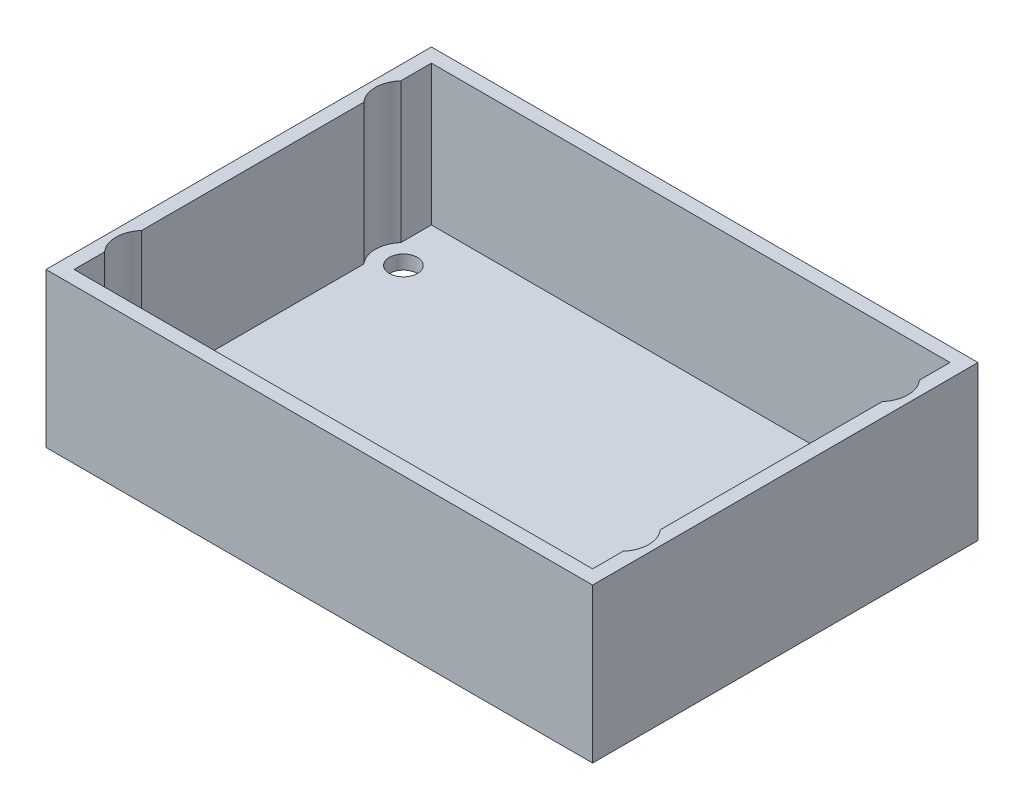
ISO-10303-21;
HEADER;
FILE_DESCRIPTION(('STEP AP214'),'2;1');
FILE_NAME('part.step','',(''),(''),'','','');
FILE_SCHEMA(('AUTOMOTIVE_DESIGN { 1 0 10303 214 1 1 1 1 }'));
ENDSEC;
DATA;
#1=APPLICATION_CONTEXT('core data for automotive mechanical design processes');
#2=APPLICATION_PROTOCOL_DEFINITION('international standard','automotive_design',2000,#1);
#3=PRODUCT_CONTEXT('',#1,'mechanical');
#4=PRODUCT('Part','Part','',(#3));
#5=PRODUCT_RELATED_PRODUCT_CATEGORY('part','',(#4));
#6=PRODUCT_DEFINITION_FORMATION('','',#4);
#7=PRODUCT_DEFINITION_CONTEXT('part definition',#1,'design');
#8=PRODUCT_DEFINITION('design','',#6,#7);
#9=PRODUCT_DEFINITION_SHAPE('','',#8);
#10=(LENGTH_UNIT() NAMED_UNIT(*) SI_UNIT(.MILLI.,.METRE.));
#11=(NAMED_UNIT(*) PLANE_ANGLE_UNIT() SI_UNIT($,.RADIAN.));
#12=(NAMED_UNIT(*) SI_UNIT($,.STERADIAN.) SOLID_ANGLE_UNIT());
#13=UNCERTAINTY_MEASURE_WITH_UNIT(LENGTH_MEASURE(1.E-05),#10,'distance_accuracy_value','');
#14=(GEOMETRIC_REPRESENTATION_CONTEXT(3) GLOBAL_UNCERTAINTY_ASSIGNED_CONTEXT((#13)) GLOBAL_UNIT_ASSIGNED_CONTEXT((#10,
#11,#12)) REPRESENTATION_CONTEXT('',''));
#15=CARTESIAN_POINT('',(0.,0.,0.));
#16=DIRECTION('',(0.,0.,1.));
#17=DIRECTION('',(1.,0.,0.));
#18=AXIS2_PLACEMENT_3D('',#15,#16,#17);
#19=CARTESIAN_POINT('',(76.,2.,-2.));
#20=DIRECTION('',(1.,0.,0.));
#21=DIRECTION('',(0.,0.,-1.));
#22=AXIS2_PLACEMENT_3D('',#19,#20,#21);
#23=PLANE('',#22);
#24=DIRECTION('',(0.,0.,-1.));
#25=VECTOR('',#24,1.);
#26=CARTESIAN_POINT('',(76.,2.,-2.));
#27=LINE('',#26,#25);
#28=CARTESIAN_POINT('',(76.,2.,-11.6457513110646));
#29=VERTEX_POINT('',#28);
#30=CARTESIAN_POINT('',(76.,2.,-43.3542486889354));
#31=VERTEX_POINT('',#30);
#32=EDGE_CURVE('E169',#29,#31,#27,.T.);
#33=ORIENTED_EDGE('',*,*,#32,.F.);
#34=DIRECTION('',(0.,1.,0.));
#35=VECTOR('',#34,1.);
#36=CARTESIAN_POINT('',(76.,2.,-11.6457513110646));
#37=LINE('',#36,#35);
#38=CARTESIAN_POINT('',(76.,22.,-11.6457513110646));
#39=VERTEX_POINT('',#38);
#40=EDGE_CURVE('E152',#29,#39,#37,.T.);
#41=ORIENTED_EDGE('',*,*,#40,.T.);
#42=DIRECTION('',(0.,0.,-1.));
#43=VECTOR('',#42,1.);
#44=CARTESIAN_POINT('',(76.,22.,-2.));
#45=LINE('',#44,#43);
#46=CARTESIAN_POINT('',(76.,22.,-43.3542486889354));
#47=VERTEX_POINT('',#46);
#48=EDGE_CURVE('E355',#39,#47,#45,.T.);
#49=ORIENTED_EDGE('',*,*,#48,.T.);
#50=DIRECTION('',(0.,1.,0.));
#51=VECTOR('',#50,1.);
#52=CARTESIAN_POINT('',(76.,2.,-43.3542486889354));
#53=LINE('',#52,#51);
#54=EDGE_CURVE('E208',#47,#31,#53,.F.);
#55=ORIENTED_EDGE('',*,*,#54,.T.);
#56=EDGE_LOOP('',(#33,#41,#49,#55));
#57=FACE_BOUND('',#56,.T.);
#58=ADVANCED_FACE('F35',(#57),#23,.F.);
#59=CARTESIAN_POINT('',(76.,2.,-48.6457513110646));
#60=VERTEX_POINT('',#59);
#61=CARTESIAN_POINT('',(76.,2.,-53.));
#62=VERTEX_POINT('',#61);
#63=EDGE_CURVE('E171',#60,#62,#27,.T.);
#64=ORIENTED_EDGE('',*,*,#63,.F.);
#65=DIRECTION('',(0.,1.,0.));
#66=VECTOR('',#65,1.);
#67=CARTESIAN_POINT('',(76.,2.,-48.6457513110646));
#68=LINE('',#67,#66);
#69=CARTESIAN_POINT('',(76.,22.,-48.6457513110646));
#70=VERTEX_POINT('',#69);
#71=EDGE_CURVE('E204',#60,#70,#68,.T.);
#72=ORIENTED_EDGE('',*,*,#71,.T.);
#73=CARTESIAN_POINT('',(76.,22.,-53.));
#74=VERTEX_POINT('',#73);
#75=EDGE_CURVE('E356',#70,#74,#45,.T.);
#76=ORIENTED_EDGE('',*,*,#75,.T.);
#77=DIRECTION('',(0.,1.,0.));
#78=VECTOR('',#77,1.);
#79=CARTESIAN_POINT('',(76.,2.,-53.));
#80=LINE('',#79,#78);
#81=EDGE_CURVE('E348',#62,#74,#80,.T.);
#82=ORIENTED_EDGE('',*,*,#81,.F.);
#83=EDGE_LOOP('',(#64,#72,#76,#82));
#84=FACE_BOUND('',#83,.T.);
#85=ADVANCED_FACE('F249',(#84),#23,.F.);
#86=CARTESIAN_POINT('',(2.,2.,-2.));
#87=DIRECTION('',(-1.,0.,0.));
#88=DIRECTION('',(0.,0.,1.));
#89=AXIS2_PLACEMENT_3D('',#86,#87,#88);
#90=PLANE('',#89);
#91=DIRECTION('',(0.,0.,1.));
#92=VECTOR('',#91,1.);
#93=CARTESIAN_POINT('',(2.,2.,-2.));
#94=LINE('',#93,#92);
#95=CARTESIAN_POINT('',(2.,2.,-43.3542486889354));
#96=VERTEX_POINT('',#95);
#97=CARTESIAN_POINT('',(2.,2.,-11.6457513110646));
#98=VERTEX_POINT('',#97);
#99=EDGE_CURVE('E180',#96,#98,#94,.T.);
#100=ORIENTED_EDGE('',*,*,#99,.F.);
#101=DIRECTION('',(0.,1.,0.));
#102=VECTOR('',#101,1.);
#103=CARTESIAN_POINT('',(2.,2.,-43.3542486889354));
#104=LINE('',#103,#102);
#105=CARTESIAN_POINT('',(2.,22.,-43.3542486889354));
#106=VERTEX_POINT('',#105);
#107=EDGE_CURVE('E194',#96,#106,#104,.T.);
#108=ORIENTED_EDGE('',*,*,#107,.T.);
#109=DIRECTION('',(0.,0.,1.));
#110=VECTOR('',#109,1.);
#111=CARTESIAN_POINT('',(2.,22.,-2.));
#112=LINE('',#111,#110);
#113=CARTESIAN_POINT('',(2.,22.,-11.6457513110646));
#114=VERTEX_POINT('',#113);
#115=EDGE_CURVE('E362',#106,#114,#112,.T.);
#116=ORIENTED_EDGE('',*,*,#115,.T.);
#117=DIRECTION('',(0.,1.,0.));
#118=VECTOR('',#117,1.);
#119=CARTESIAN_POINT('',(2.,2.,-11.6457513110646));
#120=LINE('',#119,#118);
#121=EDGE_CURVE('E188',#114,#98,#120,.F.);
#122=ORIENTED_EDGE('',*,*,#121,.T.);
#123=EDGE_LOOP('',(#100,#108,#116,#122));
#124=FACE_BOUND('',#123,.T.);
#125=ADVANCED_FACE('F255',(#124),#90,.F.);
#126=CARTESIAN_POINT('',(2.,2.,-6.3542486889354));
#127=VERTEX_POINT('',#126);
#128=CARTESIAN_POINT('',(2.,2.,-2.));
#129=VERTEX_POINT('',#128);
#130=EDGE_CURVE('E182',#127,#129,#94,.T.);
#131=ORIENTED_EDGE('',*,*,#130,.F.);
#132=DIRECTION('',(0.,1.,0.));
#133=VECTOR('',#132,1.);
#134=CARTESIAN_POINT('',(2.,2.,-6.3542486889354));
#135=LINE('',#134,#133);
#136=CARTESIAN_POINT('',(2.,22.,-6.3542486889354));
#137=VERTEX_POINT('',#136);
#138=EDGE_CURVE('E184',#127,#137,#135,.T.);
#139=ORIENTED_EDGE('',*,*,#138,.T.);
#140=CARTESIAN_POINT('',(2.,22.,-2.));
#141=VERTEX_POINT('',#140);
#142=EDGE_CURVE('E187',#137,#141,#112,.T.);
#143=ORIENTED_EDGE('',*,*,#142,.T.);
#144=DIRECTION('',(0.,1.,0.));
#145=VECTOR('',#144,1.);
#146=CARTESIAN_POINT('',(2.,2.,-2.));
#147=LINE('',#146,#145);
#148=EDGE_CURVE('E173',#129,#141,#147,.T.);
#149=ORIENTED_EDGE('',*,*,#148,.F.);
#150=EDGE_LOOP('',(#131,#139,#143,#149));
#151=FACE_BOUND('',#150,.T.);
#152=ADVANCED_FACE('F275',(#151),#90,.F.);
#153=CARTESIAN_POINT('',(0.,22.,0.));
#154=DIRECTION('',(1.,0.,0.));
#155=DIRECTION('',(0.,0.,-1.));
#156=AXIS2_PLACEMENT_3D('',#153,#154,#155);
#157=PLANE('',#156);
#158=DIRECTION('',(0.,0.,1.));
#159=VECTOR('',#158,1.);
#160=CARTESIAN_POINT('',(0.,0.,0.));
#161=LINE('',#160,#159);
#162=CARTESIAN_POINT('',(0.,0.,-55.));
#163=VERTEX_POINT('',#162);
#164=CARTESIAN_POINT('',(0.,0.,0.));
#165=VERTEX_POINT('',#164);
#166=EDGE_CURVE('E333',#163,#165,#161,.T.);
#167=ORIENTED_EDGE('',*,*,#166,.T.);
#168=DIRECTION('',(0.,-1.,0.));
#169=VECTOR('',#168,1.);
#170=CARTESIAN_POINT('',(0.,22.,0.));
#171=LINE('',#170,#169);
#172=CARTESIAN_POINT('',(0.,22.,0.));
#173=VERTEX_POINT('',#172);
#174=EDGE_CURVE('E11',#173,#165,#171,.T.);
#175=ORIENTED_EDGE('',*,*,#174,.F.);
#176=DIRECTION('',(0.,0.,1.));
#177=VECTOR('',#176,1.);
#178=CARTESIAN_POINT('',(0.,22.,0.));
#179=LINE('',#178,#177);
#180=CARTESIAN_POINT('',(0.,22.,-55.));
#181=VERTEX_POINT('',#180);
#182=EDGE_CURVE('E328',#181,#173,#179,.T.);
#183=ORIENTED_EDGE('',*,*,#182,.F.);
#184=DIRECTION('',(0.,-1.,0.));
#185=VECTOR('',#184,1.);
#186=CARTESIAN_POINT('',(0.,22.,-55.));
#187=LINE('',#186,#185);
#188=EDGE_CURVE('E322',#181,#163,#187,.T.);
#189=ORIENTED_EDGE('',*,*,#188,.T.);
#190=EDGE_LOOP('',(#167,#175,#183,#189));
#191=FACE_BOUND('',#190,.T.);
#192=ADVANCED_FACE('F37',(#191),#157,.F.);
#193=CARTESIAN_POINT('',(0.,22.,0.));
#194=DIRECTION('',(0.,0.,-1.));
#195=DIRECTION('',(-1.,0.,0.));
#196=AXIS2_PLACEMENT_3D('',#193,#194,#195);
#197=PLANE('',#196);
#198=DIRECTION('',(1.,0.,0.));
#199=VECTOR('',#198,1.);
#200=CARTESIAN_POINT('',(0.,0.,0.));
#201=LINE('',#200,#199);
#202=CARTESIAN_POINT('',(78.,0.,0.));
#203=VERTEX_POINT('',#202);
#204=EDGE_CURVE('E331',#165,#203,#201,.T.);
#205=ORIENTED_EDGE('',*,*,#204,.T.);
#206=DIRECTION('',(0.,-1.,0.));
#207=VECTOR('',#206,1.);
#208=CARTESIAN_POINT('',(78.,22.,0.));
#209=LINE('',#208,#207);
#210=CARTESIAN_POINT('',(78.,22.,0.));
#211=VERTEX_POINT('',#210);
#212=EDGE_CURVE('E44',#211,#203,#209,.T.);
#213=ORIENTED_EDGE('',*,*,#212,.F.);
#214=DIRECTION('',(1.,0.,0.));
#215=VECTOR('',#214,1.);
#216=CARTESIAN_POINT('',(0.,22.,0.));
#217=LINE('',#216,#215);
#218=EDGE_CURVE('E340',#173,#211,#217,.T.);
#219=ORIENTED_EDGE('',*,*,#218,.F.);
#220=ORIENTED_EDGE('',*,*,#174,.T.);
#221=EDGE_LOOP('',(#205,#213,#219,#220));
#222=FACE_BOUND('',#221,.T.);
#223=ADVANCED_FACE('F403',(#222),#197,.F.);
#224=CARTESIAN_POINT('',(78.,22.,0.));
#225=DIRECTION('',(-1.,0.,0.));
#226=DIRECTION('',(0.,0.,1.));
#227=AXIS2_PLACEMENT_3D('',#224,#225,#226);
#228=PLANE('',#227);
#229=DIRECTION('',(0.,0.,-1.));
#230=VECTOR('',#229,1.);
#231=CARTESIAN_POINT('',(78.,0.,0.));
#232=LINE('',#231,#230);
#233=CARTESIAN_POINT('',(78.,0.,-55.));
#234=VERTEX_POINT('',#233);
#235=EDGE_CURVE('E329',#203,#234,#232,.T.);
#236=ORIENTED_EDGE('',*,*,#235,.T.);
#237=DIRECTION('',(0.,-1.,0.));
#238=VECTOR('',#237,1.);
#239=CARTESIAN_POINT('',(78.,22.,-55.));
#240=LINE('',#239,#238);
#241=CARTESIAN_POINT('',(78.,22.,-55.));
#242=VERTEX_POINT('',#241);
#243=EDGE_CURVE('E319',#242,#234,#240,.T.);
#244=ORIENTED_EDGE('',*,*,#243,.F.);
#245=DIRECTION('',(0.,0.,-1.));
#246=VECTOR('',#245,1.);
#247=CARTESIAN_POINT('',(78.,22.,0.));
#248=LINE('',#247,#246);
#249=EDGE_CURVE('E338',#211,#242,#248,.T.);
#250=ORIENTED_EDGE('',*,*,#249,.F.);
#251=ORIENTED_EDGE('',*,*,#212,.T.);
#252=EDGE_LOOP('',(#236,#244,#250,#251));
#253=FACE_BOUND('',#252,.T.);
#254=ADVANCED_FACE('F400',(#253),#228,.F.);
#255=CARTESIAN_POINT('',(0.,22.,-55.));
#256=DIRECTION('',(0.,0.,1.));
#257=DIRECTION('',(1.,0.,0.));
#258=AXIS2_PLACEMENT_3D('',#255,#256,#257);
#259=PLANE('',#258);
#260=DIRECTION('',(-1.,0.,0.));
#261=VECTOR('',#260,1.);
#262=CARTESIAN_POINT('',(0.,0.,-55.));
#263=LINE('',#262,#261);
#264=EDGE_CURVE('E326',#234,#163,#263,.T.);
#265=ORIENTED_EDGE('',*,*,#264,.T.);
#266=ORIENTED_EDGE('',*,*,#188,.F.);
#267=DIRECTION('',(-1.,0.,0.));
#268=VECTOR('',#267,1.);
#269=CARTESIAN_POINT('',(0.,22.,-55.));
#270=LINE('',#269,#268);
#271=EDGE_CURVE('E325',#242,#181,#270,.T.);
#272=ORIENTED_EDGE('',*,*,#271,.F.);
#273=ORIENTED_EDGE('',*,*,#243,.T.);
#274=EDGE_LOOP('',(#265,#266,#272,#273));
#275=FACE_BOUND('',#274,.T.);
#276=ADVANCED_FACE('F395',(#275),#259,.F.);
#277=CARTESIAN_POINT('',(0.,22.,0.));
#278=DIRECTION('',(0.,-1.,0.));
#279=DIRECTION('',(0.,0.,-1.));
#280=AXIS2_PLACEMENT_3D('',#277,#278,#279);
#281=PLANE('',#280);
#282=ORIENTED_EDGE('',*,*,#48,.F.);
#283=CARTESIAN_POINT('',(73.,22.,-9.));
#284=DIRECTION('',(0.,1.,0.));
#285=DIRECTION('',(0.,0.,1.));
#286=AXIS2_PLACEMENT_3D('',#283,#284,#285);
#287=CIRCLE('',#286,4.00000000000001);
#288=CARTESIAN_POINT('',(76.,22.,-6.3542486889354));
#289=VERTEX_POINT('',#288);
#290=EDGE_CURVE('E154',#289,#39,#287,.T.);
#291=ORIENTED_EDGE('',*,*,#290,.F.);
#292=CARTESIAN_POINT('',(76.,22.,-2.));
#293=VERTEX_POINT('',#292);
#294=EDGE_CURVE('E163',#293,#289,#45,.T.);
#295=ORIENTED_EDGE('',*,*,#294,.F.);
#296=DIRECTION('',(1.,0.,0.));
#297=VECTOR('',#296,1.);
#298=CARTESIAN_POINT('',(2.,22.,-2.));
#299=LINE('',#298,#297);
#300=EDGE_CURVE('E357',#141,#293,#299,.T.);
#301=ORIENTED_EDGE('',*,*,#300,.F.);
#302=ORIENTED_EDGE('',*,*,#142,.F.);
#303=CARTESIAN_POINT('',(5.,22.,-9.));
#304=DIRECTION('',(0.,1.,0.));
#305=DIRECTION('',(0.,0.,1.));
#306=AXIS2_PLACEMENT_3D('',#303,#304,#305);
#307=CIRCLE('',#306,4.);
#308=EDGE_CURVE('E192',#114,#137,#307,.T.);
#309=ORIENTED_EDGE('',*,*,#308,.F.);
#310=ORIENTED_EDGE('',*,*,#115,.F.);
#311=CARTESIAN_POINT('',(5.,22.,-46.));
#312=DIRECTION('',(0.,1.,0.));
#313=DIRECTION('',(0.,0.,1.));
#314=AXIS2_PLACEMENT_3D('',#311,#312,#313);
#315=CIRCLE('',#314,4.);
#316=CARTESIAN_POINT('',(2.,22.,-48.6457513110646));
#317=VERTEX_POINT('',#316);
#318=EDGE_CURVE('E202',#317,#106,#315,.T.);
#319=ORIENTED_EDGE('',*,*,#318,.F.);
#320=CARTESIAN_POINT('',(2.,22.,-53.));
#321=VERTEX_POINT('',#320);
#322=EDGE_CURVE('E360',#321,#317,#112,.T.);
#323=ORIENTED_EDGE('',*,*,#322,.F.);
#324=DIRECTION('',(-1.,0.,0.));
#325=VECTOR('',#324,1.);
#326=CARTESIAN_POINT('',(2.,22.,-53.));
#327=LINE('',#326,#325);
#328=EDGE_CURVE('E352',#74,#321,#327,.T.);
#329=ORIENTED_EDGE('',*,*,#328,.F.);
#330=ORIENTED_EDGE('',*,*,#75,.F.);
#331=CARTESIAN_POINT('',(73.,22.,-46.));
#332=DIRECTION('',(0.,1.,0.));
#333=DIRECTION('',(0.,0.,1.));
#334=AXIS2_PLACEMENT_3D('',#331,#332,#333);
#335=CIRCLE('',#334,4.00000000000001);
#336=EDGE_CURVE('E211',#47,#70,#335,.T.);
#337=ORIENTED_EDGE('',*,*,#336,.F.);
#338=EDGE_LOOP('',(#282,#291,#295,#301,#302,#309,#310,#319,#323,#329,#330,#337));
#339=FACE_BOUND('',#338,.T.);
#340=ORIENTED_EDGE('',*,*,#182,.T.);
#341=ORIENTED_EDGE('',*,*,#218,.T.);
#342=ORIENTED_EDGE('',*,*,#249,.T.);
#343=ORIENTED_EDGE('',*,*,#271,.T.);
#344=EDGE_LOOP('',(#340,#341,#342,#343));
#345=FACE_BOUND('',#344,.T.);
#346=ADVANCED_FACE('F373',(#339,#345),#281,.F.);
#347=CARTESIAN_POINT('',(0.,0.,0.));
#348=DIRECTION('',(0.,-1.,0.));
#349=DIRECTION('',(0.,0.,-1.));
#350=AXIS2_PLACEMENT_3D('',#347,#348,#349);
#351=PLANE('',#350);
#352=CARTESIAN_POINT('',(73.,0.,-9.));
#353=DIRECTION('',(0.,1.,0.));
#354=DIRECTION('',(0.,0.,1.));
#355=AXIS2_PLACEMENT_3D('',#352,#353,#354);
#356=CIRCLE('',#355,2.);
#357=CARTESIAN_POINT('',(73.,0.,-7.));
#358=VERTEX_POINT('',#357);
#359=EDGE_CURVE('E228',#358,#358,#356,.T.);
#360=ORIENTED_EDGE('',*,*,#359,.T.);
#361=EDGE_LOOP('',(#360));
#362=FACE_BOUND('',#361,.T.);
#363=CARTESIAN_POINT('',(73.,0.,-46.));
#364=DIRECTION('',(0.,1.,0.));
#365=DIRECTION('',(0.,0.,1.));
#366=AXIS2_PLACEMENT_3D('',#363,#364,#365);
#367=CIRCLE('',#366,2.);
#368=CARTESIAN_POINT('',(73.,0.,-44.));
#369=VERTEX_POINT('',#368);
#370=EDGE_CURVE('E225',#369,#369,#367,.T.);
#371=ORIENTED_EDGE('',*,*,#370,.T.);
#372=EDGE_LOOP('',(#371));
#373=FACE_BOUND('',#372,.T.);
#374=CARTESIAN_POINT('',(5.,0.,-46.));
#375=DIRECTION('',(0.,1.,0.));
#376=DIRECTION('',(0.,0.,1.));
#377=AXIS2_PLACEMENT_3D('',#374,#375,#376);
#378=CIRCLE('',#377,2.);
#379=CARTESIAN_POINT('',(5.,0.,-44.));
#380=VERTEX_POINT('',#379);
#381=EDGE_CURVE('E221',#380,#380,#378,.T.);
#382=ORIENTED_EDGE('',*,*,#381,.T.);
#383=EDGE_LOOP('',(#382));
#384=FACE_BOUND('',#383,.T.);
#385=CARTESIAN_POINT('',(5.,0.,-9.));
#386=DIRECTION('',(0.,1.,0.));
#387=DIRECTION('',(0.,0.,1.));
#388=AXIS2_PLACEMENT_3D('',#385,#386,#387);
#389=CIRCLE('',#388,2.);
#390=CARTESIAN_POINT('',(5.,0.,-7.));
#391=VERTEX_POINT('',#390);
#392=EDGE_CURVE('E217',#391,#391,#389,.T.);
#393=ORIENTED_EDGE('',*,*,#392,.T.);
#394=EDGE_LOOP('',(#393));
#395=FACE_BOUND('',#394,.T.);
#396=ORIENTED_EDGE('',*,*,#166,.F.);
#397=ORIENTED_EDGE('',*,*,#264,.F.);
#398=ORIENTED_EDGE('',*,*,#235,.F.);
#399=ORIENTED_EDGE('',*,*,#204,.F.);
#400=EDGE_LOOP('',(#396,#397,#398,#399));
#401=FACE_BOUND('',#400,.T.);
#402=ADVANCED_FACE('F272',(#362,#373,#384,#395,#401),#351,.T.);
#403=ORIENTED_EDGE('',*,*,#322,.T.);
#404=DIRECTION('',(0.,1.,0.));
#405=VECTOR('',#404,1.);
#406=CARTESIAN_POINT('',(2.,2.,-48.6457513110646));
#407=LINE('',#406,#405);
#408=CARTESIAN_POINT('',(2.,2.,-48.6457513110646));
#409=VERTEX_POINT('',#408);
#410=EDGE_CURVE('E198',#317,#409,#407,.F.);
#411=ORIENTED_EDGE('',*,*,#410,.T.);
#412=CARTESIAN_POINT('',(2.,2.,-53.));
#413=VERTEX_POINT('',#412);
#414=EDGE_CURVE('E178',#413,#409,#94,.T.);
#415=ORIENTED_EDGE('',*,*,#414,.F.);
#416=DIRECTION('',(0.,1.,0.));
#417=VECTOR('',#416,1.);
#418=CARTESIAN_POINT('',(2.,2.,-53.));
#419=LINE('',#418,#417);
#420=EDGE_CURVE('E336',#413,#321,#419,.T.);
#421=ORIENTED_EDGE('',*,*,#420,.T.);
#422=EDGE_LOOP('',(#403,#411,#415,#421));
#423=FACE_BOUND('',#422,.T.);
#424=ADVANCED_FACE('F267',(#423),#90,.F.);
#425=CARTESIAN_POINT('',(2.,2.,-53.));
#426=DIRECTION('',(0.,0.,-1.));
#427=DIRECTION('',(-1.,0.,0.));
#428=AXIS2_PLACEMENT_3D('',#425,#426,#427);
#429=PLANE('',#428);
#430=ORIENTED_EDGE('',*,*,#328,.T.);
#431=ORIENTED_EDGE('',*,*,#420,.F.);
#432=DIRECTION('',(-1.,0.,0.));
#433=VECTOR('',#432,1.);
#434=CARTESIAN_POINT('',(2.,2.,-53.));
#435=LINE('',#434,#433);
#436=EDGE_CURVE('E168',#62,#413,#435,.T.);
#437=ORIENTED_EDGE('',*,*,#436,.F.);
#438=ORIENTED_EDGE('',*,*,#81,.T.);
#439=EDGE_LOOP('',(#430,#431,#437,#438));
#440=FACE_BOUND('',#439,.T.);
#441=ADVANCED_FACE('F261',(#440),#429,.F.);
#442=ORIENTED_EDGE('',*,*,#294,.T.);
#443=DIRECTION('',(0.,1.,0.));
#444=VECTOR('',#443,1.);
#445=CARTESIAN_POINT('',(76.,2.,-6.3542486889354));
#446=LINE('',#445,#444);
#447=CARTESIAN_POINT('',(76.,2.,-6.3542486889354));
#448=VERTEX_POINT('',#447);
#449=EDGE_CURVE('E149',#289,#448,#446,.F.);
#450=ORIENTED_EDGE('',*,*,#449,.T.);
#451=CARTESIAN_POINT('',(76.,2.,-2.));
#452=VERTEX_POINT('',#451);
#453=EDGE_CURVE('E160',#452,#448,#27,.T.);
#454=ORIENTED_EDGE('',*,*,#453,.F.);
#455=DIRECTION('',(0.,1.,0.));
#456=VECTOR('',#455,1.);
#457=CARTESIAN_POINT('',(76.,2.,-2.));
#458=LINE('',#457,#456);
#459=EDGE_CURVE('E346',#452,#293,#458,.T.);
#460=ORIENTED_EDGE('',*,*,#459,.T.);
#461=EDGE_LOOP('',(#442,#450,#454,#460));
#462=FACE_BOUND('',#461,.T.);
#463=ADVANCED_FACE('F159',(#462),#23,.F.);
#464=CARTESIAN_POINT('',(2.,2.,-2.));
#465=DIRECTION('',(0.,0.,1.));
#466=DIRECTION('',(1.,0.,0.));
#467=AXIS2_PLACEMENT_3D('',#464,#465,#466);
#468=PLANE('',#467);
#469=ORIENTED_EDGE('',*,*,#300,.T.);
#470=ORIENTED_EDGE('',*,*,#459,.F.);
#471=DIRECTION('',(1.,0.,0.));
#472=VECTOR('',#471,1.);
#473=CARTESIAN_POINT('',(2.,2.,-2.));
#474=LINE('',#473,#472);
#475=EDGE_CURVE('E167',#129,#452,#474,.T.);
#476=ORIENTED_EDGE('',*,*,#475,.F.);
#477=ORIENTED_EDGE('',*,*,#148,.T.);
#478=EDGE_LOOP('',(#469,#470,#476,#477));
#479=FACE_BOUND('',#478,.T.);
#480=ADVANCED_FACE('F260',(#479),#468,.F.);
#481=CARTESIAN_POINT('',(0.,2.,0.));
#482=DIRECTION('',(0.,-1.,0.));
#483=DIRECTION('',(0.,0.,-1.));
#484=AXIS2_PLACEMENT_3D('',#481,#482,#483);
#485=PLANE('',#484);
#486=CARTESIAN_POINT('',(73.,2.,-9.));
#487=DIRECTION('',(0.,-1.,0.));
#488=DIRECTION('',(0.,0.,-1.));
#489=AXIS2_PLACEMENT_3D('',#486,#487,#488);
#490=CIRCLE('',#489,2.);
#491=CARTESIAN_POINT('',(73.,2.,-11.));
#492=VERTEX_POINT('',#491);
#493=EDGE_CURVE('E39',#492,#492,#490,.T.);
#494=ORIENTED_EDGE('',*,*,#493,.T.);
#495=EDGE_LOOP('',(#494));
#496=FACE_BOUND('',#495,.T.);
#497=CARTESIAN_POINT('',(73.,2.,-46.));
#498=DIRECTION('',(0.,-1.,0.));
#499=DIRECTION('',(0.,0.,-1.));
#500=AXIS2_PLACEMENT_3D('',#497,#498,#499);
#501=CIRCLE('',#500,2.);
#502=CARTESIAN_POINT('',(73.,2.,-48.));
#503=VERTEX_POINT('',#502);
#504=EDGE_CURVE('E224',#503,#503,#501,.T.);
#505=ORIENTED_EDGE('',*,*,#504,.T.);
#506=EDGE_LOOP('',(#505));
#507=FACE_BOUND('',#506,.T.);
#508=CARTESIAN_POINT('',(5.,2.,-46.));
#509=DIRECTION('',(0.,-1.,0.));
#510=DIRECTION('',(0.,0.,-1.));
#511=AXIS2_PLACEMENT_3D('',#508,#509,#510);
#512=CIRCLE('',#511,2.);
#513=CARTESIAN_POINT('',(5.,2.,-48.));
#514=VERTEX_POINT('',#513);
#515=EDGE_CURVE('E220',#514,#514,#512,.T.);
#516=ORIENTED_EDGE('',*,*,#515,.T.);
#517=EDGE_LOOP('',(#516));
#518=FACE_BOUND('',#517,.T.);
#519=CARTESIAN_POINT('',(5.,2.,-9.));
#520=DIRECTION('',(0.,-1.,0.));
#521=DIRECTION('',(0.,0.,-1.));
#522=AXIS2_PLACEMENT_3D('',#519,#520,#521);
#523=CIRCLE('',#522,2.);
#524=CARTESIAN_POINT('',(5.,2.,-11.));
#525=VERTEX_POINT('',#524);
#526=EDGE_CURVE('E215',#525,#525,#523,.T.);
#527=ORIENTED_EDGE('',*,*,#526,.T.);
#528=EDGE_LOOP('',(#527));
#529=FACE_BOUND('',#528,.T.);
#530=ORIENTED_EDGE('',*,*,#453,.T.);
#531=CARTESIAN_POINT('',(73.,2.,-9.));
#532=DIRECTION('',(0.,1.,0.));
#533=DIRECTION('',(0.,0.,1.));
#534=AXIS2_PLACEMENT_3D('',#531,#532,#533);
#535=CIRCLE('',#534,4.00000000000001);
#536=EDGE_CURVE('E52',#448,#29,#535,.T.);
#537=ORIENTED_EDGE('',*,*,#536,.T.);
#538=ORIENTED_EDGE('',*,*,#32,.T.);
#539=CARTESIAN_POINT('',(73.,2.,-46.));
#540=DIRECTION('',(0.,1.,0.));
#541=DIRECTION('',(0.,0.,1.));
#542=AXIS2_PLACEMENT_3D('',#539,#540,#541);
#543=CIRCLE('',#542,4.00000000000001);
#544=EDGE_CURVE('E58',#31,#60,#543,.T.);
#545=ORIENTED_EDGE('',*,*,#544,.T.);
#546=ORIENTED_EDGE('',*,*,#63,.T.);
#547=ORIENTED_EDGE('',*,*,#436,.T.);
#548=ORIENTED_EDGE('',*,*,#414,.T.);
#549=CARTESIAN_POINT('',(5.,2.,-46.));
#550=DIRECTION('',(0.,1.,0.));
#551=DIRECTION('',(0.,0.,1.));
#552=AXIS2_PLACEMENT_3D('',#549,#550,#551);
#553=CIRCLE('',#552,4.);
#554=EDGE_CURVE('E201',#409,#96,#553,.T.);
#555=ORIENTED_EDGE('',*,*,#554,.T.);
#556=ORIENTED_EDGE('',*,*,#99,.T.);
#557=CARTESIAN_POINT('',(5.,2.,-9.));
#558=DIRECTION('',(0.,1.,0.));
#559=DIRECTION('',(0.,0.,1.));
#560=AXIS2_PLACEMENT_3D('',#557,#558,#559);
#561=CIRCLE('',#560,4.);
#562=EDGE_CURVE('E191',#98,#127,#561,.T.);
#563=ORIENTED_EDGE('',*,*,#562,.T.);
#564=ORIENTED_EDGE('',*,*,#130,.T.);
#565=ORIENTED_EDGE('',*,*,#475,.T.);
#566=EDGE_LOOP('',(#530,#537,#538,#545,#546,#547,#548,#555,#556,#563,#564,#565));
#567=FACE_BOUND('',#566,.T.);
#568=ADVANCED_FACE('F165',(#496,#507,#518,#529,#567),#485,.F.);
#569=CARTESIAN_POINT('',(5.,2.,-9.));
#570=DIRECTION('',(0.,1.,0.));
#571=DIRECTION('',(0.,0.,1.));
#572=AXIS2_PLACEMENT_3D('',#569,#570,#571);
#573=CYLINDRICAL_SURFACE('',#572,4.);
#574=ORIENTED_EDGE('',*,*,#562,.F.);
#575=ORIENTED_EDGE('',*,*,#121,.F.);
#576=ORIENTED_EDGE('',*,*,#308,.T.);
#577=ORIENTED_EDGE('',*,*,#138,.F.);
#578=EDGE_LOOP('',(#574,#575,#576,#577));
#579=FACE_BOUND('',#578,.T.);
#580=ADVANCED_FACE('F280',(#579),#573,.F.);
#581=CARTESIAN_POINT('',(5.,2.,-46.));
#582=DIRECTION('',(0.,1.,0.));
#583=DIRECTION('',(0.,0.,1.));
#584=AXIS2_PLACEMENT_3D('',#581,#582,#583);
#585=CYLINDRICAL_SURFACE('',#584,4.);
#586=ORIENTED_EDGE('',*,*,#554,.F.);
#587=ORIENTED_EDGE('',*,*,#410,.F.);
#588=ORIENTED_EDGE('',*,*,#318,.T.);
#589=ORIENTED_EDGE('',*,*,#107,.F.);
#590=EDGE_LOOP('',(#586,#587,#588,#589));
#591=FACE_BOUND('',#590,.T.);
#592=ADVANCED_FACE('F283',(#591),#585,.F.);
#593=CARTESIAN_POINT('',(73.,2.,-46.));
#594=DIRECTION('',(0.,1.,0.));
#595=DIRECTION('',(0.,0.,1.));
#596=AXIS2_PLACEMENT_3D('',#593,#594,#595);
#597=CYLINDRICAL_SURFACE('',#596,4.00000000000001);
#598=ORIENTED_EDGE('',*,*,#544,.F.);
#599=ORIENTED_EDGE('',*,*,#54,.F.);
#600=ORIENTED_EDGE('',*,*,#336,.T.);
#601=ORIENTED_EDGE('',*,*,#71,.F.);
#602=EDGE_LOOP('',(#598,#599,#600,#601));
#603=FACE_BOUND('',#602,.T.);
#604=ADVANCED_FACE('F287',(#603),#597,.F.);
#605=CARTESIAN_POINT('',(73.,2.,-9.));
#606=DIRECTION('',(0.,1.,0.));
#607=DIRECTION('',(0.,0.,1.));
#608=AXIS2_PLACEMENT_3D('',#605,#606,#607);
#609=CYLINDRICAL_SURFACE('',#608,4.00000000000001);
#610=ORIENTED_EDGE('',*,*,#536,.F.);
#611=ORIENTED_EDGE('',*,*,#449,.F.);
#612=ORIENTED_EDGE('',*,*,#290,.T.);
#613=ORIENTED_EDGE('',*,*,#40,.F.);
#614=EDGE_LOOP('',(#610,#611,#612,#613));
#615=FACE_BOUND('',#614,.T.);
#616=ADVANCED_FACE('F148',(#615),#609,.F.);
#617=CARTESIAN_POINT('',(5.,0.,-9.));
#618=DIRECTION('',(0.,1.,0.));
#619=DIRECTION('',(0.,0.,1.));
#620=AXIS2_PLACEMENT_3D('',#617,#618,#619);
#621=CYLINDRICAL_SURFACE('',#620,2.);
#622=ORIENTED_EDGE('',*,*,#392,.F.);
#623=EDGE_LOOP('',(#622));
#624=FACE_BOUND('',#623,.T.);
#625=ORIENTED_EDGE('',*,*,#526,.F.);
#626=EDGE_LOOP('',(#625));
#627=FACE_BOUND('',#626,.T.);
#628=ADVANCED_FACE('F294',(#624,#627),#621,.F.);
#629=CARTESIAN_POINT('',(5.,0.,-46.));
#630=DIRECTION('',(0.,1.,0.));
#631=DIRECTION('',(0.,0.,1.));
#632=AXIS2_PLACEMENT_3D('',#629,#630,#631);
#633=CYLINDRICAL_SURFACE('',#632,2.);
#634=ORIENTED_EDGE('',*,*,#381,.F.);
#635=EDGE_LOOP('',(#634));
#636=FACE_BOUND('',#635,.T.);
#637=ORIENTED_EDGE('',*,*,#515,.F.);
#638=EDGE_LOOP('',(#637));
#639=FACE_BOUND('',#638,.T.);
#640=ADVANCED_FACE('F245',(#636,#639),#633,.F.);
#641=CARTESIAN_POINT('',(73.,0.,-46.));
#642=DIRECTION('',(0.,1.,0.));
#643=DIRECTION('',(0.,0.,1.));
#644=AXIS2_PLACEMENT_3D('',#641,#642,#643);
#645=CYLINDRICAL_SURFACE('',#644,2.);
#646=ORIENTED_EDGE('',*,*,#370,.F.);
#647=EDGE_LOOP('',(#646));
#648=FACE_BOUND('',#647,.T.);
#649=ORIENTED_EDGE('',*,*,#504,.F.);
#650=EDGE_LOOP('',(#649));
#651=FACE_BOUND('',#650,.T.);
#652=ADVANCED_FACE('F239',(#648,#651),#645,.F.);
#653=CARTESIAN_POINT('',(73.,0.,-9.));
#654=DIRECTION('',(0.,1.,0.));
#655=DIRECTION('',(0.,0.,1.));
#656=AXIS2_PLACEMENT_3D('',#653,#654,#655);
#657=CYLINDRICAL_SURFACE('',#656,2.);
#658=ORIENTED_EDGE('',*,*,#359,.F.);
#659=EDGE_LOOP('',(#658));
#660=FACE_BOUND('',#659,.T.);
#661=ORIENTED_EDGE('',*,*,#493,.F.);
#662=EDGE_LOOP('',(#661));
#663=FACE_BOUND('',#662,.T.);
#664=ADVANCED_FACE('F237',(#660,#663),#657,.F.);
#665=CLOSED_SHELL('',(#58,#85,#125,#152,#192,#223,#254,#276,#346,#402,#424,#441,#463,#480,#568,
#580,#592,#604,#616,#628,#640,#652,#664));
#666=MANIFOLD_SOLID_BREP('B2',#665);
#667=ADVANCED_BREP_SHAPE_REPRESENTATION('',(#18,#666),#14);
#668=SHAPE_DEFINITION_REPRESENTATION(#9,#667);
ENDSEC;
END-ISO-10303-21;
